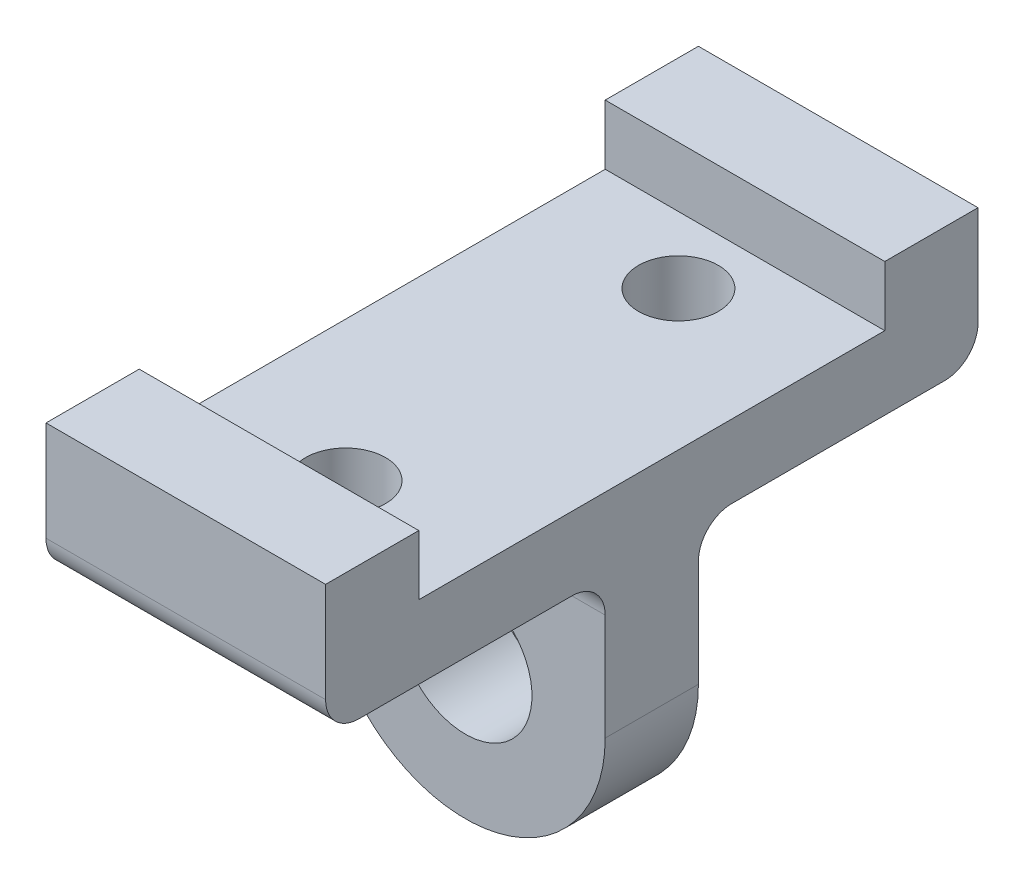
ISO-10303-21;
HEADER;
FILE_DESCRIPTION(('STEP AP214'),'2;1');
FILE_NAME('part.step','',(''),(''),'','','');
FILE_SCHEMA(('AUTOMOTIVE_DESIGN { 1 0 10303 214 1 1 1 1 }'));
ENDSEC;
DATA;
#1=APPLICATION_CONTEXT('core data for automotive mechanical design processes');
#2=APPLICATION_PROTOCOL_DEFINITION('international standard','automotive_design',2000,#1);
#3=PRODUCT_CONTEXT('',#1,'mechanical');
#4=PRODUCT('Part','Part','',(#3));
#5=PRODUCT_RELATED_PRODUCT_CATEGORY('part','',(#4));
#6=PRODUCT_DEFINITION_FORMATION('','',#4);
#7=PRODUCT_DEFINITION_CONTEXT('part definition',#1,'design');
#8=PRODUCT_DEFINITION('design','',#6,#7);
#9=PRODUCT_DEFINITION_SHAPE('','',#8);
#10=(LENGTH_UNIT() NAMED_UNIT(*) SI_UNIT(.MILLI.,.METRE.));
#11=(NAMED_UNIT(*) PLANE_ANGLE_UNIT() SI_UNIT($,.RADIAN.));
#12=(NAMED_UNIT(*) SI_UNIT($,.STERADIAN.) SOLID_ANGLE_UNIT());
#13=UNCERTAINTY_MEASURE_WITH_UNIT(LENGTH_MEASURE(1.E-05),#10,'distance_accuracy_value','');
#14=(GEOMETRIC_REPRESENTATION_CONTEXT(3) GLOBAL_UNCERTAINTY_ASSIGNED_CONTEXT((#13)) GLOBAL_UNIT_ASSIGNED_CONTEXT((#10,
#11,#12)) REPRESENTATION_CONTEXT('',''));
#15=CARTESIAN_POINT('',(0.,0.,0.));
#16=DIRECTION('',(0.,0.,1.));
#17=DIRECTION('',(1.,0.,0.));
#18=AXIS2_PLACEMENT_3D('',#15,#16,#17);
#19=CARTESIAN_POINT('',(0.,0.,0.));
#20=DIRECTION('',(0.,-1.,0.));
#21=DIRECTION('',(0.,0.,-1.));
#22=AXIS2_PLACEMENT_3D('',#19,#20,#21);
#23=PLANE('',#22);
#24=CARTESIAN_POINT('',(0.,0.,25.));
#25=DIRECTION('',(0.,-1.,0.));
#26=DIRECTION('',(0.,0.,1.));
#27=AXIS2_PLACEMENT_3D('',#24,#25,#26);
#28=CIRCLE('',#27,6.);
#29=CARTESIAN_POINT('',(0.,0.,31.));
#30=VERTEX_POINT('',#29);
#31=EDGE_CURVE('E194',#30,#30,#28,.T.);
#32=ORIENTED_EDGE('',*,*,#31,.F.);
#33=EDGE_LOOP('',(#32));
#34=FACE_BOUND('',#33,.T.);
#35=DIRECTION('',(0.,0.,1.));
#36=VECTOR('',#35,1.);
#37=CARTESIAN_POINT('',(-21.,0.,49.));
#38=LINE('',#37,#36);
#39=CARTESIAN_POINT('',(-21.,0.,12.));
#40=VERTEX_POINT('',#39);
#41=CARTESIAN_POINT('',(-21.,0.,44.));
#42=VERTEX_POINT('',#41);
#43=EDGE_CURVE('E265',#40,#42,#38,.T.);
#44=ORIENTED_EDGE('',*,*,#43,.F.);
#45=DIRECTION('',(-1.,0.,0.));
#46=VECTOR('',#45,1.);
#47=CARTESIAN_POINT('',(0.,0.,12.));
#48=LINE('',#47,#46);
#49=CARTESIAN_POINT('',(21.,0.,12.));
#50=VERTEX_POINT('',#49);
#51=EDGE_CURVE('E307',#40,#50,#48,.F.);
#52=ORIENTED_EDGE('',*,*,#51,.T.);
#53=DIRECTION('',(0.,0.,-1.));
#54=VECTOR('',#53,1.);
#55=CARTESIAN_POINT('',(21.,0.,49.));
#56=LINE('',#55,#54);
#57=CARTESIAN_POINT('',(21.,0.,44.));
#58=VERTEX_POINT('',#57);
#59=EDGE_CURVE('E261',#58,#50,#56,.T.);
#60=ORIENTED_EDGE('',*,*,#59,.F.);
#61=DIRECTION('',(1.,0.,0.));
#62=VECTOR('',#61,1.);
#63=CARTESIAN_POINT('',(-21.,0.,44.));
#64=LINE('',#63,#62);
#65=EDGE_CURVE('E304',#58,#42,#64,.F.);
#66=ORIENTED_EDGE('',*,*,#65,.T.);
#67=EDGE_LOOP('',(#44,#52,#60,#66));
#68=FACE_BOUND('',#67,.T.);
#69=ADVANCED_FACE('F39',(#34,#68),#23,.T.);
#70=CARTESIAN_POINT('',(21.,20.,49.));
#71=DIRECTION('',(-1.,0.,0.));
#72=DIRECTION('',(0.,0.,1.));
#73=AXIS2_PLACEMENT_3D('',#70,#71,#72);
#74=PLANE('',#73);
#75=DIRECTION('',(0.,-1.,0.));
#76=VECTOR('',#75,1.);
#77=CARTESIAN_POINT('',(21.,20.,49.));
#78=LINE('',#77,#76);
#79=CARTESIAN_POINT('',(21.,20.,49.));
#80=VERTEX_POINT('',#79);
#81=CARTESIAN_POINT('',(21.,5.,49.));
#82=VERTEX_POINT('',#81);
#83=EDGE_CURVE('E260',#80,#82,#78,.T.);
#84=ORIENTED_EDGE('',*,*,#83,.T.);
#85=CARTESIAN_POINT('',(21.,5.,44.));
#86=DIRECTION('',(-1.,0.,0.));
#87=DIRECTION('',(0.,0.,1.));
#88=AXIS2_PLACEMENT_3D('',#85,#86,#87);
#89=CIRCLE('',#88,5.);
#90=EDGE_CURVE('E316',#82,#58,#89,.F.);
#91=ORIENTED_EDGE('',*,*,#90,.T.);
#92=ORIENTED_EDGE('',*,*,#59,.T.);
#93=CARTESIAN_POINT('',(21.,-5.,12.));
#94=DIRECTION('',(-1.,0.,0.));
#95=DIRECTION('',(0.,0.,1.));
#96=AXIS2_PLACEMENT_3D('',#93,#94,#95);
#97=CIRCLE('',#96,5.);
#98=CARTESIAN_POINT('',(21.,-5.00000000000001,7.00000000000002));
#99=VERTEX_POINT('',#98);
#100=EDGE_CURVE('E11',#50,#99,#97,.T.);
#101=ORIENTED_EDGE('',*,*,#100,.T.);
#102=DIRECTION('',(0.,1.,0.));
#103=VECTOR('',#102,1.);
#104=CARTESIAN_POINT('',(21.,-21.,7.00000000000002));
#105=LINE('',#104,#103);
#106=CARTESIAN_POINT('',(21.,-21.,7.00000000000002));
#107=VERTEX_POINT('',#106);
#108=EDGE_CURVE('E180',#107,#99,#105,.T.);
#109=ORIENTED_EDGE('',*,*,#108,.F.);
#110=DIRECTION('',(0.,0.,1.));
#111=VECTOR('',#110,1.);
#112=CARTESIAN_POINT('',(21.,-21.,-6.99999999999999));
#113=LINE('',#112,#111);
#114=CARTESIAN_POINT('',(21.,-21.,-6.99999999999999));
#115=VERTEX_POINT('',#114);
#116=EDGE_CURVE('E167',#115,#107,#113,.T.);
#117=ORIENTED_EDGE('',*,*,#116,.F.);
#118=DIRECTION('',(0.,1.,0.));
#119=VECTOR('',#118,1.);
#120=CARTESIAN_POINT('',(21.,-21.,-6.99999999999999));
#121=LINE('',#120,#119);
#122=CARTESIAN_POINT('',(21.,-5.00000000000001,-6.99999999999999));
#123=VERTEX_POINT('',#122);
#124=EDGE_CURVE('E201',#115,#123,#121,.T.);
#125=ORIENTED_EDGE('',*,*,#124,.T.);
#126=CARTESIAN_POINT('',(21.,-5.,-12.));
#127=DIRECTION('',(-1.,0.,0.));
#128=DIRECTION('',(0.,0.,1.));
#129=AXIS2_PLACEMENT_3D('',#126,#127,#128);
#130=CIRCLE('',#129,5.);
#131=CARTESIAN_POINT('',(21.,0.,-12.));
#132=VERTEX_POINT('',#131);
#133=EDGE_CURVE('E327',#123,#132,#130,.T.);
#134=ORIENTED_EDGE('',*,*,#133,.T.);
#135=CARTESIAN_POINT('',(21.,0.,-44.));
#136=VERTEX_POINT('',#135);
#137=EDGE_CURVE('E234',#132,#136,#56,.T.);
#138=ORIENTED_EDGE('',*,*,#137,.T.);
#139=CARTESIAN_POINT('',(21.,5.,-44.));
#140=DIRECTION('',(-1.,0.,0.));
#141=DIRECTION('',(0.,0.,1.));
#142=AXIS2_PLACEMENT_3D('',#139,#140,#141);
#143=CIRCLE('',#142,5.);
#144=CARTESIAN_POINT('',(21.,5.,-49.));
#145=VERTEX_POINT('',#144);
#146=EDGE_CURVE('E63',#136,#145,#143,.F.);
#147=ORIENTED_EDGE('',*,*,#146,.T.);
#148=DIRECTION('',(0.,-1.,0.));
#149=VECTOR('',#148,1.);
#150=CARTESIAN_POINT('',(21.,20.,-49.));
#151=LINE('',#150,#149);
#152=CARTESIAN_POINT('',(21.,20.,-49.));
#153=VERTEX_POINT('',#152);
#154=EDGE_CURVE('E280',#153,#145,#151,.T.);
#155=ORIENTED_EDGE('',*,*,#154,.F.);
#156=DIRECTION('',(0.,0.,-1.));
#157=VECTOR('',#156,1.);
#158=CARTESIAN_POINT('',(21.,20.,49.));
#159=LINE('',#158,#157);
#160=CARTESIAN_POINT('',(21.,20.,-35.));
#161=VERTEX_POINT('',#160);
#162=EDGE_CURVE('E249',#161,#153,#159,.T.);
#163=ORIENTED_EDGE('',*,*,#162,.F.);
#164=DIRECTION('',(0.,1.,0.));
#165=VECTOR('',#164,1.);
#166=CARTESIAN_POINT('',(21.,11.,-35.));
#167=LINE('',#166,#165);
#168=CARTESIAN_POINT('',(21.,11.,-35.));
#169=VERTEX_POINT('',#168);
#170=EDGE_CURVE('E224',#169,#161,#167,.T.);
#171=ORIENTED_EDGE('',*,*,#170,.F.);
#172=DIRECTION('',(0.,0.,-1.));
#173=VECTOR('',#172,1.);
#174=CARTESIAN_POINT('',(21.,11.,0.));
#175=LINE('',#174,#173);
#176=CARTESIAN_POINT('',(21.,11.,35.));
#177=VERTEX_POINT('',#176);
#178=EDGE_CURVE('E208',#177,#169,#175,.T.);
#179=ORIENTED_EDGE('',*,*,#178,.F.);
#180=DIRECTION('',(0.,1.,0.));
#181=VECTOR('',#180,1.);
#182=CARTESIAN_POINT('',(21.,11.,35.));
#183=LINE('',#182,#181);
#184=CARTESIAN_POINT('',(21.,20.,35.));
#185=VERTEX_POINT('',#184);
#186=EDGE_CURVE('E230',#177,#185,#183,.T.);
#187=ORIENTED_EDGE('',*,*,#186,.T.);
#188=EDGE_CURVE('E244',#80,#185,#159,.T.);
#189=ORIENTED_EDGE('',*,*,#188,.F.);
#190=EDGE_LOOP('',(#84,#91,#92,#101,#109,#117,#125,#134,#138,#147,#155,#163,#171,#179,#187,#189));
#191=FACE_BOUND('',#190,.T.);
#192=ADVANCED_FACE('F342',(#191),#74,.F.);
#193=CARTESIAN_POINT('',(-21.,20.,49.));
#194=DIRECTION('',(1.,0.,0.));
#195=DIRECTION('',(0.,0.,-1.));
#196=AXIS2_PLACEMENT_3D('',#193,#194,#195);
#197=PLANE('',#196);
#198=ORIENTED_EDGE('',*,*,#43,.T.);
#199=CARTESIAN_POINT('',(-21.,5.,44.));
#200=DIRECTION('',(1.,0.,0.));
#201=DIRECTION('',(0.,0.,-1.));
#202=AXIS2_PLACEMENT_3D('',#199,#200,#201);
#203=CIRCLE('',#202,5.);
#204=CARTESIAN_POINT('',(-21.,5.,49.));
#205=VERTEX_POINT('',#204);
#206=EDGE_CURVE('E321',#42,#205,#203,.F.);
#207=ORIENTED_EDGE('',*,*,#206,.T.);
#208=DIRECTION('',(0.,-1.,0.));
#209=VECTOR('',#208,1.);
#210=CARTESIAN_POINT('',(-21.,20.,49.));
#211=LINE('',#210,#209);
#212=CARTESIAN_POINT('',(-21.,20.,49.));
#213=VERTEX_POINT('',#212);
#214=EDGE_CURVE('E272',#213,#205,#211,.T.);
#215=ORIENTED_EDGE('',*,*,#214,.F.);
#216=DIRECTION('',(0.,0.,1.));
#217=VECTOR('',#216,1.);
#218=CARTESIAN_POINT('',(-21.,20.,49.));
#219=LINE('',#218,#217);
#220=CARTESIAN_POINT('',(-21.,20.,35.));
#221=VERTEX_POINT('',#220);
#222=EDGE_CURVE('E252',#221,#213,#219,.T.);
#223=ORIENTED_EDGE('',*,*,#222,.F.);
#224=DIRECTION('',(0.,1.,0.));
#225=VECTOR('',#224,1.);
#226=CARTESIAN_POINT('',(-21.,11.,35.));
#227=LINE('',#226,#225);
#228=CARTESIAN_POINT('',(-21.,11.,35.));
#229=VERTEX_POINT('',#228);
#230=EDGE_CURVE('E235',#229,#221,#227,.T.);
#231=ORIENTED_EDGE('',*,*,#230,.F.);
#232=DIRECTION('',(0.,0.,1.));
#233=VECTOR('',#232,1.);
#234=CARTESIAN_POINT('',(-21.,11.,0.));
#235=LINE('',#234,#233);
#236=CARTESIAN_POINT('',(-21.,11.,-35.));
#237=VERTEX_POINT('',#236);
#238=EDGE_CURVE('E217',#237,#229,#235,.T.);
#239=ORIENTED_EDGE('',*,*,#238,.F.);
#240=DIRECTION('',(0.,1.,0.));
#241=VECTOR('',#240,1.);
#242=CARTESIAN_POINT('',(-21.,11.,-35.));
#243=LINE('',#242,#241);
#244=CARTESIAN_POINT('',(-21.,20.,-35.));
#245=VERTEX_POINT('',#244);
#246=EDGE_CURVE('E238',#237,#245,#243,.T.);
#247=ORIENTED_EDGE('',*,*,#246,.T.);
#248=CARTESIAN_POINT('',(-21.,20.,-49.));
#249=VERTEX_POINT('',#248);
#250=EDGE_CURVE('E253',#249,#245,#219,.T.);
#251=ORIENTED_EDGE('',*,*,#250,.F.);
#252=DIRECTION('',(0.,-1.,0.));
#253=VECTOR('',#252,1.);
#254=CARTESIAN_POINT('',(-21.,20.,-49.));
#255=LINE('',#254,#253);
#256=CARTESIAN_POINT('',(-21.,5.,-49.));
#257=VERTEX_POINT('',#256);
#258=EDGE_CURVE('E276',#249,#257,#255,.T.);
#259=ORIENTED_EDGE('',*,*,#258,.T.);
#260=CARTESIAN_POINT('',(-21.,5.,-44.));
#261=DIRECTION('',(1.,0.,0.));
#262=DIRECTION('',(0.,0.,-1.));
#263=AXIS2_PLACEMENT_3D('',#260,#261,#262);
#264=CIRCLE('',#263,5.);
#265=CARTESIAN_POINT('',(-21.,0.,-44.));
#266=VERTEX_POINT('',#265);
#267=EDGE_CURVE('E55',#257,#266,#264,.F.);
#268=ORIENTED_EDGE('',*,*,#267,.T.);
#269=CARTESIAN_POINT('',(-21.,0.,-12.));
#270=VERTEX_POINT('',#269);
#271=EDGE_CURVE('E268',#266,#270,#38,.T.);
#272=ORIENTED_EDGE('',*,*,#271,.T.);
#273=CARTESIAN_POINT('',(-21.,-5.,-12.));
#274=DIRECTION('',(1.,0.,0.));
#275=DIRECTION('',(0.,0.,-1.));
#276=AXIS2_PLACEMENT_3D('',#273,#274,#275);
#277=CIRCLE('',#276,5.);
#278=CARTESIAN_POINT('',(-21.,-5.00000000000001,-6.99999999999999));
#279=VERTEX_POINT('',#278);
#280=EDGE_CURVE('E330',#270,#279,#277,.T.);
#281=ORIENTED_EDGE('',*,*,#280,.T.);
#282=DIRECTION('',(0.,1.,0.));
#283=VECTOR('',#282,1.);
#284=CARTESIAN_POINT('',(-21.,-21.,-6.99999999999999));
#285=LINE('',#284,#283);
#286=CARTESIAN_POINT('',(-21.,-21.,-6.99999999999999));
#287=VERTEX_POINT('',#286);
#288=EDGE_CURVE('E161',#287,#279,#285,.T.);
#289=ORIENTED_EDGE('',*,*,#288,.F.);
#290=DIRECTION('',(0.,0.,-1.));
#291=VECTOR('',#290,1.);
#292=CARTESIAN_POINT('',(-21.,-21.,-6.99999999999999));
#293=LINE('',#292,#291);
#294=CARTESIAN_POINT('',(-21.,-20.9999999999999,7.00000000000002));
#295=VERTEX_POINT('',#294);
#296=EDGE_CURVE('E155',#295,#287,#293,.T.);
#297=ORIENTED_EDGE('',*,*,#296,.F.);
#298=DIRECTION('',(0.,1.,0.));
#299=VECTOR('',#298,1.);
#300=CARTESIAN_POINT('',(-21.,-21.,7.00000000000002));
#301=LINE('',#300,#299);
#302=CARTESIAN_POINT('',(-21.,-5.00000000000001,7.00000000000002));
#303=VERTEX_POINT('',#302);
#304=EDGE_CURVE('E159',#295,#303,#301,.T.);
#305=ORIENTED_EDGE('',*,*,#304,.T.);
#306=CARTESIAN_POINT('',(-21.,-5.,12.));
#307=DIRECTION('',(1.,0.,0.));
#308=DIRECTION('',(0.,0.,-1.));
#309=AXIS2_PLACEMENT_3D('',#306,#307,#308);
#310=CIRCLE('',#309,5.);
#311=EDGE_CURVE('E48',#303,#40,#310,.T.);
#312=ORIENTED_EDGE('',*,*,#311,.T.);
#313=EDGE_LOOP('',(#198,#207,#215,#223,#231,#239,#247,#251,#259,#268,#272,#281,#289,#297,#305,#312));
#314=FACE_BOUND('',#313,.T.);
#315=ADVANCED_FACE('F158',(#314),#197,.F.);
#316=CARTESIAN_POINT('',(0.,20.,0.));
#317=DIRECTION('',(0.,-1.,0.));
#318=DIRECTION('',(0.,0.,-1.));
#319=AXIS2_PLACEMENT_3D('',#316,#317,#318);
#320=PLANE('',#319);
#321=DIRECTION('',(-1.,0.,0.));
#322=VECTOR('',#321,1.);
#323=CARTESIAN_POINT('',(0.,20.,35.));
#324=LINE('',#323,#322);
#325=EDGE_CURVE('E213',#185,#221,#324,.T.);
#326=ORIENTED_EDGE('',*,*,#325,.T.);
#327=ORIENTED_EDGE('',*,*,#222,.T.);
#328=DIRECTION('',(1.,0.,0.));
#329=VECTOR('',#328,1.);
#330=CARTESIAN_POINT('',(-21.,20.,49.));
#331=LINE('',#330,#329);
#332=EDGE_CURVE('E257',#213,#80,#331,.T.);
#333=ORIENTED_EDGE('',*,*,#332,.T.);
#334=ORIENTED_EDGE('',*,*,#188,.T.);
#335=EDGE_LOOP('',(#326,#327,#333,#334));
#336=FACE_BOUND('',#335,.T.);
#337=ADVANCED_FACE('F354',(#336),#320,.F.);
#338=CARTESIAN_POINT('',(-21.,20.,-49.));
#339=DIRECTION('',(0.,0.,1.));
#340=DIRECTION('',(1.,0.,0.));
#341=AXIS2_PLACEMENT_3D('',#338,#339,#340);
#342=PLANE('',#341);
#343=ORIENTED_EDGE('',*,*,#154,.T.);
#344=DIRECTION('',(-1.,0.,0.));
#345=VECTOR('',#344,1.);
#346=CARTESIAN_POINT('',(-21.,5.,-49.));
#347=LINE('',#346,#345);
#348=EDGE_CURVE('E324',#145,#257,#347,.T.);
#349=ORIENTED_EDGE('',*,*,#348,.T.);
#350=ORIENTED_EDGE('',*,*,#258,.F.);
#351=DIRECTION('',(-1.,0.,0.));
#352=VECTOR('',#351,1.);
#353=CARTESIAN_POINT('',(-21.,20.,-49.));
#354=LINE('',#353,#352);
#355=EDGE_CURVE('E248',#153,#249,#354,.T.);
#356=ORIENTED_EDGE('',*,*,#355,.F.);
#357=EDGE_LOOP('',(#343,#349,#350,#356));
#358=FACE_BOUND('',#357,.T.);
#359=ADVANCED_FACE('F366',(#358),#342,.F.);
#360=CARTESIAN_POINT('',(-21.,20.,49.));
#361=DIRECTION('',(0.,0.,-1.));
#362=DIRECTION('',(-1.,0.,0.));
#363=AXIS2_PLACEMENT_3D('',#360,#361,#362);
#364=PLANE('',#363);
#365=ORIENTED_EDGE('',*,*,#214,.T.);
#366=DIRECTION('',(1.,0.,0.));
#367=VECTOR('',#366,1.);
#368=CARTESIAN_POINT('',(21.,5.,49.));
#369=LINE('',#368,#367);
#370=EDGE_CURVE('E310',#205,#82,#369,.T.);
#371=ORIENTED_EDGE('',*,*,#370,.T.);
#372=ORIENTED_EDGE('',*,*,#83,.F.);
#373=ORIENTED_EDGE('',*,*,#332,.F.);
#374=EDGE_LOOP('',(#365,#371,#372,#373));
#375=FACE_BOUND('',#374,.T.);
#376=ADVANCED_FACE('F350',(#375),#364,.F.);
#377=ORIENTED_EDGE('',*,*,#250,.T.);
#378=DIRECTION('',(-1.,0.,0.));
#379=VECTOR('',#378,1.);
#380=CARTESIAN_POINT('',(0.,20.,-35.));
#381=LINE('',#380,#379);
#382=EDGE_CURVE('E207',#161,#245,#381,.T.);
#383=ORIENTED_EDGE('',*,*,#382,.F.);
#384=ORIENTED_EDGE('',*,*,#162,.T.);
#385=ORIENTED_EDGE('',*,*,#355,.T.);
#386=EDGE_LOOP('',(#377,#383,#384,#385));
#387=FACE_BOUND('',#386,.T.);
#388=ADVANCED_FACE('F373',(#387),#320,.F.);
#389=CARTESIAN_POINT('',(0.,0.,-25.));
#390=DIRECTION('',(0.,-1.,0.));
#391=DIRECTION('',(0.,0.,-1.));
#392=AXIS2_PLACEMENT_3D('',#389,#390,#391);
#393=CIRCLE('',#392,6.);
#394=CARTESIAN_POINT('',(0.,0.,-31.));
#395=VERTEX_POINT('',#394);
#396=EDGE_CURVE('E286',#395,#395,#393,.T.);
#397=ORIENTED_EDGE('',*,*,#396,.F.);
#398=EDGE_LOOP('',(#397));
#399=FACE_BOUND('',#398,.T.);
#400=ORIENTED_EDGE('',*,*,#137,.F.);
#401=DIRECTION('',(1.,0.,0.));
#402=VECTOR('',#401,1.);
#403=CARTESIAN_POINT('',(0.,0.,-12.));
#404=LINE('',#403,#402);
#405=EDGE_CURVE('E299',#132,#270,#404,.F.);
#406=ORIENTED_EDGE('',*,*,#405,.T.);
#407=ORIENTED_EDGE('',*,*,#271,.F.);
#408=DIRECTION('',(-1.,0.,0.));
#409=VECTOR('',#408,1.);
#410=CARTESIAN_POINT('',(21.,0.,-44.));
#411=LINE('',#410,#409);
#412=EDGE_CURVE('E296',#266,#136,#411,.F.);
#413=ORIENTED_EDGE('',*,*,#412,.T.);
#414=EDGE_LOOP('',(#400,#406,#407,#413));
#415=FACE_BOUND('',#414,.T.);
#416=ADVANCED_FACE('F385',(#399,#415),#23,.T.);
#417=CARTESIAN_POINT('',(0.,11.,35.));
#418=DIRECTION('',(0.,0.,-1.));
#419=DIRECTION('',(-1.,0.,0.));
#420=AXIS2_PLACEMENT_3D('',#417,#418,#419);
#421=PLANE('',#420);
#422=ORIENTED_EDGE('',*,*,#325,.F.);
#423=ORIENTED_EDGE('',*,*,#186,.F.);
#424=DIRECTION('',(-1.,0.,0.));
#425=VECTOR('',#424,1.);
#426=CARTESIAN_POINT('',(0.,11.,35.));
#427=LINE('',#426,#425);
#428=EDGE_CURVE('E221',#177,#229,#427,.T.);
#429=ORIENTED_EDGE('',*,*,#428,.T.);
#430=ORIENTED_EDGE('',*,*,#230,.T.);
#431=EDGE_LOOP('',(#422,#423,#429,#430));
#432=FACE_BOUND('',#431,.T.);
#433=ADVANCED_FACE('F383',(#432),#421,.T.);
#434=CARTESIAN_POINT('',(0.,11.,-35.));
#435=DIRECTION('',(0.,0.,-1.));
#436=DIRECTION('',(-1.,0.,0.));
#437=AXIS2_PLACEMENT_3D('',#434,#435,#436);
#438=PLANE('',#437);
#439=ORIENTED_EDGE('',*,*,#382,.T.);
#440=ORIENTED_EDGE('',*,*,#246,.F.);
#441=DIRECTION('',(-1.,0.,0.));
#442=VECTOR('',#441,1.);
#443=CARTESIAN_POINT('',(0.,11.,-35.));
#444=LINE('',#443,#442);
#445=EDGE_CURVE('E212',#169,#237,#444,.T.);
#446=ORIENTED_EDGE('',*,*,#445,.F.);
#447=ORIENTED_EDGE('',*,*,#170,.T.);
#448=EDGE_LOOP('',(#439,#440,#446,#447));
#449=FACE_BOUND('',#448,.T.);
#450=ADVANCED_FACE('F378',(#449),#438,.F.);
#451=CARTESIAN_POINT('',(0.,11.,0.));
#452=DIRECTION('',(0.,1.,0.));
#453=DIRECTION('',(0.,0.,1.));
#454=AXIS2_PLACEMENT_3D('',#451,#452,#453);
#455=PLANE('',#454);
#456=CARTESIAN_POINT('',(0.,11.,-25.));
#457=DIRECTION('',(0.,1.,0.));
#458=DIRECTION('',(0.,0.,1.));
#459=AXIS2_PLACEMENT_3D('',#456,#457,#458);
#460=CIRCLE('',#459,6.);
#461=CARTESIAN_POINT('',(0.,11.,-19.));
#462=VERTEX_POINT('',#461);
#463=EDGE_CURVE('E185',#462,#462,#460,.T.);
#464=ORIENTED_EDGE('',*,*,#463,.F.);
#465=EDGE_LOOP('',(#464));
#466=FACE_BOUND('',#465,.T.);
#467=CARTESIAN_POINT('',(0.,11.,25.));
#468=DIRECTION('',(0.,1.,0.));
#469=DIRECTION('',(0.,0.,1.));
#470=AXIS2_PLACEMENT_3D('',#467,#468,#469);
#471=CIRCLE('',#470,6.);
#472=CARTESIAN_POINT('',(0.,11.,31.));
#473=VERTEX_POINT('',#472);
#474=EDGE_CURVE('E191',#473,#473,#471,.T.);
#475=ORIENTED_EDGE('',*,*,#474,.F.);
#476=EDGE_LOOP('',(#475));
#477=FACE_BOUND('',#476,.T.);
#478=ORIENTED_EDGE('',*,*,#178,.T.);
#479=ORIENTED_EDGE('',*,*,#445,.T.);
#480=ORIENTED_EDGE('',*,*,#238,.T.);
#481=ORIENTED_EDGE('',*,*,#428,.F.);
#482=EDGE_LOOP('',(#478,#479,#480,#481));
#483=FACE_BOUND('',#482,.T.);
#484=ADVANCED_FACE('F381',(#466,#477,#483),#455,.T.);
#485=CARTESIAN_POINT('',(-21.,-21.,-6.99999999999999));
#486=DIRECTION('',(0.,0.,1.));
#487=DIRECTION('',(1.,0.,0.));
#488=AXIS2_PLACEMENT_3D('',#485,#486,#487);
#489=PLANE('',#488);
#490=CARTESIAN_POINT('',(0.,-21.,-6.99999999999999));
#491=DIRECTION('',(0.,0.,-1.));
#492=DIRECTION('',(-1.,0.,0.));
#493=AXIS2_PLACEMENT_3D('',#490,#491,#492);
#494=CIRCLE('',#493,10.);
#495=CARTESIAN_POINT('',(-10.,-21.,-6.99999999999999));
#496=VERTEX_POINT('',#495);
#497=EDGE_CURVE('E292',#496,#496,#494,.T.);
#498=ORIENTED_EDGE('',*,*,#497,.F.);
#499=EDGE_LOOP('',(#498));
#500=FACE_BOUND('',#499,.T.);
#501=ORIENTED_EDGE('',*,*,#288,.T.);
#502=DIRECTION('',(1.,0.,0.));
#503=VECTOR('',#502,1.);
#504=CARTESIAN_POINT('',(-21.,-5.,-6.99999999999999));
#505=LINE('',#504,#503);
#506=EDGE_CURVE('E283',#279,#123,#505,.T.);
#507=ORIENTED_EDGE('',*,*,#506,.T.);
#508=ORIENTED_EDGE('',*,*,#124,.F.);
#509=CARTESIAN_POINT('',(0.,-21.,-6.99999999999999));
#510=DIRECTION('',(0.,0.,1.));
#511=DIRECTION('',(1.,0.,0.));
#512=AXIS2_PLACEMENT_3D('',#509,#510,#511);
#513=CIRCLE('',#512,21.);
#514=EDGE_CURVE('E168',#287,#115,#513,.T.);
#515=ORIENTED_EDGE('',*,*,#514,.F.);
#516=EDGE_LOOP('',(#501,#507,#508,#515));
#517=FACE_BOUND('',#516,.T.);
#518=ADVANCED_FACE('F449',(#500,#517),#489,.F.);
#519=CARTESIAN_POINT('',(-21.,-21.,7.00000000000002));
#520=DIRECTION('',(0.,0.,-1.));
#521=DIRECTION('',(-1.,0.,0.));
#522=AXIS2_PLACEMENT_3D('',#519,#520,#521);
#523=PLANE('',#522);
#524=CARTESIAN_POINT('',(0.,-21.,7.00000000000002));
#525=DIRECTION('',(0.,0.,-1.));
#526=DIRECTION('',(-1.,0.,0.));
#527=AXIS2_PLACEMENT_3D('',#524,#525,#526);
#528=CIRCLE('',#527,10.);
#529=CARTESIAN_POINT('',(-10.,-21.,7.00000000000002));
#530=VERTEX_POINT('',#529);
#531=EDGE_CURVE('E288',#530,#530,#528,.T.);
#532=ORIENTED_EDGE('',*,*,#531,.T.);
#533=EDGE_LOOP('',(#532));
#534=FACE_BOUND('',#533,.T.);
#535=ORIENTED_EDGE('',*,*,#108,.T.);
#536=DIRECTION('',(-1.,0.,0.));
#537=VECTOR('',#536,1.);
#538=CARTESIAN_POINT('',(-21.,-5.,7.00000000000002));
#539=LINE('',#538,#537);
#540=EDGE_CURVE('E178',#99,#303,#539,.T.);
#541=ORIENTED_EDGE('',*,*,#540,.T.);
#542=ORIENTED_EDGE('',*,*,#304,.F.);
#543=CARTESIAN_POINT('',(0.,-21.,7.00000000000002));
#544=DIRECTION('',(0.,0.,1.));
#545=DIRECTION('',(1.,0.,0.));
#546=AXIS2_PLACEMENT_3D('',#543,#544,#545);
#547=CIRCLE('',#546,21.);
#548=EDGE_CURVE('E175',#295,#107,#547,.T.);
#549=ORIENTED_EDGE('',*,*,#548,.T.);
#550=EDGE_LOOP('',(#535,#541,#542,#549));
#551=FACE_BOUND('',#550,.T.);
#552=ADVANCED_FACE('F174',(#534,#551),#523,.F.);
#553=CARTESIAN_POINT('',(0.,-21.,7.00000000000002));
#554=DIRECTION('',(0.,0.,1.));
#555=DIRECTION('',(1.,0.,0.));
#556=AXIS2_PLACEMENT_3D('',#553,#554,#555);
#557=CYLINDRICAL_SURFACE('',#556,21.);
#558=ORIENTED_EDGE('',*,*,#514,.T.);
#559=ORIENTED_EDGE('',*,*,#116,.T.);
#560=ORIENTED_EDGE('',*,*,#548,.F.);
#561=ORIENTED_EDGE('',*,*,#296,.T.);
#562=EDGE_LOOP('',(#558,#559,#560,#561));
#563=FACE_BOUND('',#562,.T.);
#564=ADVANCED_FACE('F182',(#563),#557,.T.);
#565=CARTESIAN_POINT('',(0.,21.,25.));
#566=DIRECTION('',(0.,-1.,0.));
#567=DIRECTION('',(0.,0.,-1.));
#568=AXIS2_PLACEMENT_3D('',#565,#566,#567);
#569=CYLINDRICAL_SURFACE('',#568,6.);
#570=ORIENTED_EDGE('',*,*,#474,.T.);
#571=EDGE_LOOP('',(#570));
#572=FACE_BOUND('',#571,.T.);
#573=ORIENTED_EDGE('',*,*,#31,.T.);
#574=EDGE_LOOP('',(#573));
#575=FACE_BOUND('',#574,.T.);
#576=ADVANCED_FACE('F522',(#572,#575),#569,.F.);
#577=CARTESIAN_POINT('',(0.,21.,-25.));
#578=DIRECTION('',(0.,-1.,0.));
#579=DIRECTION('',(0.,0.,-1.));
#580=AXIS2_PLACEMENT_3D('',#577,#578,#579);
#581=CYLINDRICAL_SURFACE('',#580,6.);
#582=ORIENTED_EDGE('',*,*,#463,.T.);
#583=EDGE_LOOP('',(#582));
#584=FACE_BOUND('',#583,.T.);
#585=ORIENTED_EDGE('',*,*,#396,.T.);
#586=EDGE_LOOP('',(#585));
#587=FACE_BOUND('',#586,.T.);
#588=ADVANCED_FACE('F512',(#584,#587),#581,.F.);
#589=CARTESIAN_POINT('',(0.,-21.,14.));
#590=DIRECTION('',(0.,0.,-1.));
#591=DIRECTION('',(-1.,0.,0.));
#592=AXIS2_PLACEMENT_3D('',#589,#590,#591);
#593=CYLINDRICAL_SURFACE('',#592,10.);
#594=ORIENTED_EDGE('',*,*,#497,.T.);
#595=EDGE_LOOP('',(#594));
#596=FACE_BOUND('',#595,.T.);
#597=ORIENTED_EDGE('',*,*,#531,.F.);
#598=EDGE_LOOP('',(#597));
#599=FACE_BOUND('',#598,.T.);
#600=ADVANCED_FACE('F413',(#596,#599),#593,.F.);
#601=CARTESIAN_POINT('',(-21.,-5.,-12.));
#602=DIRECTION('',(1.,0.,0.));
#603=DIRECTION('',(0.,0.,-1.));
#604=AXIS2_PLACEMENT_3D('',#601,#602,#603);
#605=CYLINDRICAL_SURFACE('',#604,5.);
#606=ORIENTED_EDGE('',*,*,#280,.F.);
#607=ORIENTED_EDGE('',*,*,#405,.F.);
#608=ORIENTED_EDGE('',*,*,#133,.F.);
#609=ORIENTED_EDGE('',*,*,#506,.F.);
#610=EDGE_LOOP('',(#606,#607,#608,#609));
#611=FACE_BOUND('',#610,.T.);
#612=ADVANCED_FACE('F410',(#611),#605,.F.);
#613=CARTESIAN_POINT('',(-21.,-5.,12.));
#614=DIRECTION('',(-1.,0.,0.));
#615=DIRECTION('',(0.,0.,1.));
#616=AXIS2_PLACEMENT_3D('',#613,#614,#615);
#617=CYLINDRICAL_SURFACE('',#616,5.);
#618=ORIENTED_EDGE('',*,*,#100,.F.);
#619=ORIENTED_EDGE('',*,*,#51,.F.);
#620=ORIENTED_EDGE('',*,*,#311,.F.);
#621=ORIENTED_EDGE('',*,*,#540,.F.);
#622=EDGE_LOOP('',(#618,#619,#620,#621));
#623=FACE_BOUND('',#622,.T.);
#624=ADVANCED_FACE('F341',(#623),#617,.F.);
#625=CARTESIAN_POINT('',(-21.,5.,44.));
#626=DIRECTION('',(-1.,0.,0.));
#627=DIRECTION('',(0.,0.,1.));
#628=AXIS2_PLACEMENT_3D('',#625,#626,#627);
#629=CYLINDRICAL_SURFACE('',#628,5.);
#630=ORIENTED_EDGE('',*,*,#206,.F.);
#631=ORIENTED_EDGE('',*,*,#65,.F.);
#632=ORIENTED_EDGE('',*,*,#90,.F.);
#633=ORIENTED_EDGE('',*,*,#370,.F.);
#634=EDGE_LOOP('',(#630,#631,#632,#633));
#635=FACE_BOUND('',#634,.T.);
#636=ADVANCED_FACE('F344',(#635),#629,.T.);
#637=CARTESIAN_POINT('',(-21.,5.,-44.));
#638=DIRECTION('',(1.,0.,0.));
#639=DIRECTION('',(0.,0.,-1.));
#640=AXIS2_PLACEMENT_3D('',#637,#638,#639);
#641=CYLINDRICAL_SURFACE('',#640,5.);
#642=ORIENTED_EDGE('',*,*,#146,.F.);
#643=ORIENTED_EDGE('',*,*,#412,.F.);
#644=ORIENTED_EDGE('',*,*,#267,.F.);
#645=ORIENTED_EDGE('',*,*,#348,.F.);
#646=EDGE_LOOP('',(#642,#643,#644,#645));
#647=FACE_BOUND('',#646,.T.);
#648=ADVANCED_FACE('F41',(#647),#641,.T.);
#649=CLOSED_SHELL('',(#69,#192,#315,#337,#359,#376,#388,#416,#433,#450,#484,#518,#552,#564,#576,
#588,#600,#612,#624,#636,#648));
#650=MANIFOLD_SOLID_BREP('B2',#649);
#651=ADVANCED_BREP_SHAPE_REPRESENTATION('',(#18,#650),#14);
#652=SHAPE_DEFINITION_REPRESENTATION(#9,#651);
ENDSEC;
END-ISO-10303-21;
